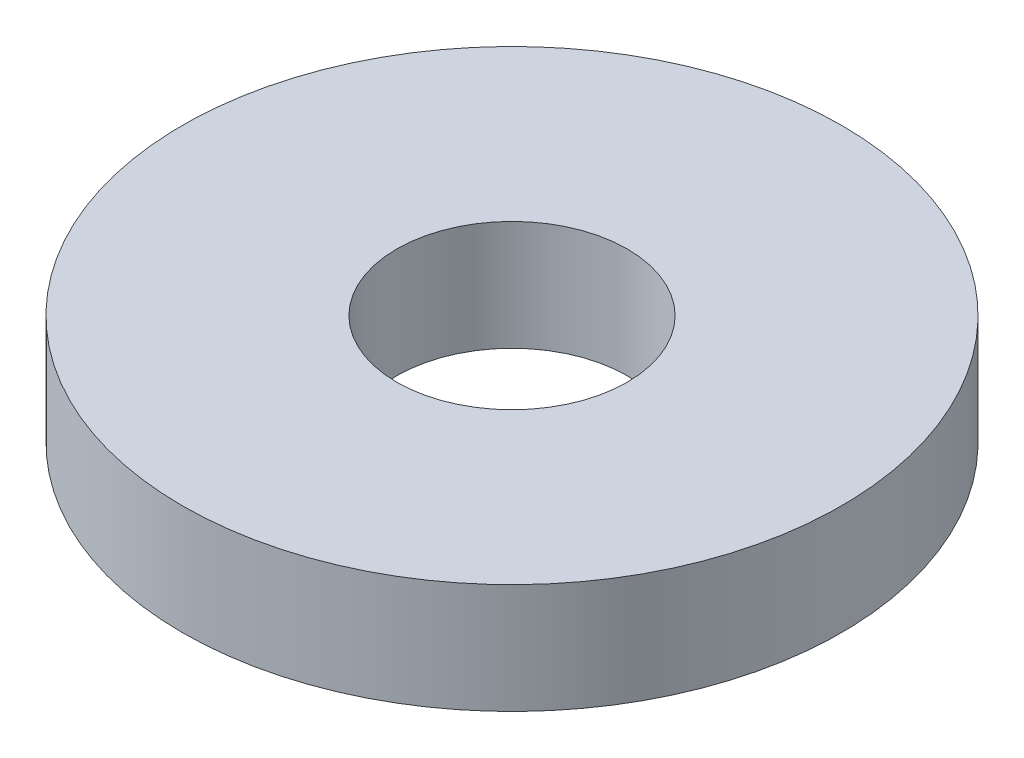
ISO-10303-21;
HEADER;
FILE_DESCRIPTION(('STEP AP214'),'2;1');
FILE_NAME('part.step','',(''),(''),'','','');
FILE_SCHEMA(('AUTOMOTIVE_DESIGN { 1 0 10303 214 1 1 1 1 }'));
ENDSEC;
DATA;
#1=APPLICATION_CONTEXT('core data for automotive mechanical design processes');
#2=APPLICATION_PROTOCOL_DEFINITION('international standard','automotive_design',2000,#1);
#3=PRODUCT_CONTEXT('',#1,'mechanical');
#4=PRODUCT('Part','Part','',(#3));
#5=PRODUCT_RELATED_PRODUCT_CATEGORY('part','',(#4));
#6=PRODUCT_DEFINITION_FORMATION('','',#4);
#7=PRODUCT_DEFINITION_CONTEXT('part definition',#1,'design');
#8=PRODUCT_DEFINITION('design','',#6,#7);
#9=PRODUCT_DEFINITION_SHAPE('','',#8);
#10=(LENGTH_UNIT() NAMED_UNIT(*) SI_UNIT(.MILLI.,.METRE.));
#11=(NAMED_UNIT(*) PLANE_ANGLE_UNIT() SI_UNIT($,.RADIAN.));
#12=(NAMED_UNIT(*) SI_UNIT($,.STERADIAN.) SOLID_ANGLE_UNIT());
#13=UNCERTAINTY_MEASURE_WITH_UNIT(LENGTH_MEASURE(1.E-05),#10,'distance_accuracy_value','');
#14=(GEOMETRIC_REPRESENTATION_CONTEXT(3) GLOBAL_UNCERTAINTY_ASSIGNED_CONTEXT((#13)) GLOBAL_UNIT_ASSIGNED_CONTEXT((#10,
#11,#12)) REPRESENTATION_CONTEXT('',''));
#15=CARTESIAN_POINT('',(0.,0.,0.));
#16=DIRECTION('',(0.,0.,1.));
#17=DIRECTION('',(1.,0.,0.));
#18=AXIS2_PLACEMENT_3D('',#15,#16,#17);
#19=CARTESIAN_POINT('',(0.,2.,0.));
#20=DIRECTION('',(0.,1.,0.));
#21=DIRECTION('',(0.,0.,1.));
#22=AXIS2_PLACEMENT_3D('',#19,#20,#21);
#23=PLANE('',#22);
#24=CARTESIAN_POINT('',(0.,2.,0.));
#25=DIRECTION('',(0.,1.,0.));
#26=DIRECTION('',(0.,0.,1.));
#27=AXIS2_PLACEMENT_3D('',#24,#25,#26);
#28=CIRCLE('',#27,6.);
#29=CARTESIAN_POINT('',(0.,2.,6.));
#30=VERTEX_POINT('',#29);
#31=EDGE_CURVE('E10',#30,#30,#28,.T.);
#32=ORIENTED_EDGE('',*,*,#31,.T.);
#33=EDGE_LOOP('',(#32));
#34=FACE_BOUND('',#33,.T.);
#35=CARTESIAN_POINT('',(0.,2.,0.));
#36=DIRECTION('',(0.,1.,0.));
#37=DIRECTION('',(0.,0.,1.));
#38=AXIS2_PLACEMENT_3D('',#35,#36,#37);
#39=CIRCLE('',#38,2.1);
#40=CARTESIAN_POINT('',(0.,2.,2.1));
#41=VERTEX_POINT('',#40);
#42=EDGE_CURVE('E41',#41,#41,#39,.T.);
#43=ORIENTED_EDGE('',*,*,#42,.F.);
#44=EDGE_LOOP('',(#43));
#45=FACE_BOUND('',#44,.T.);
#46=ADVANCED_FACE('F30',(#34,#45),#23,.T.);
#47=CARTESIAN_POINT('',(0.,0.,0.));
#48=DIRECTION('',(0.,1.,0.));
#49=DIRECTION('',(0.,0.,1.));
#50=AXIS2_PLACEMENT_3D('',#47,#48,#49);
#51=PLANE('',#50);
#52=CARTESIAN_POINT('',(0.,0.,0.));
#53=DIRECTION('',(0.,1.,0.));
#54=DIRECTION('',(0.,0.,1.));
#55=AXIS2_PLACEMENT_3D('',#52,#53,#54);
#56=CIRCLE('',#55,6.);
#57=CARTESIAN_POINT('',(0.,0.,6.));
#58=VERTEX_POINT('',#57);
#59=EDGE_CURVE('E34',#58,#58,#56,.T.);
#60=ORIENTED_EDGE('',*,*,#59,.F.);
#61=EDGE_LOOP('',(#60));
#62=FACE_BOUND('',#61,.T.);
#63=CARTESIAN_POINT('',(0.,0.,0.));
#64=DIRECTION('',(0.,1.,0.));
#65=DIRECTION('',(0.,0.,1.));
#66=AXIS2_PLACEMENT_3D('',#63,#64,#65);
#67=CIRCLE('',#66,2.1);
#68=CARTESIAN_POINT('',(0.,0.,2.1));
#69=VERTEX_POINT('',#68);
#70=EDGE_CURVE('E43',#69,#69,#67,.T.);
#71=ORIENTED_EDGE('',*,*,#70,.T.);
#72=EDGE_LOOP('',(#71));
#73=FACE_BOUND('',#72,.T.);
#74=ADVANCED_FACE('F53',(#62,#73),#51,.F.);
#75=CARTESIAN_POINT('',(0.,2.,0.));
#76=DIRECTION('',(0.,-1.,0.));
#77=DIRECTION('',(0.,0.,-1.));
#78=AXIS2_PLACEMENT_3D('',#75,#76,#77);
#79=CYLINDRICAL_SURFACE('',#78,6.);
#80=ORIENTED_EDGE('',*,*,#31,.F.);
#81=EDGE_LOOP('',(#80));
#82=FACE_BOUND('',#81,.T.);
#83=ORIENTED_EDGE('',*,*,#59,.T.);
#84=EDGE_LOOP('',(#83));
#85=FACE_BOUND('',#84,.T.);
#86=ADVANCED_FACE('F32',(#82,#85),#79,.T.);
#87=CARTESIAN_POINT('',(0.,2.,0.));
#88=DIRECTION('',(0.,-1.,0.));
#89=DIRECTION('',(0.,0.,-1.));
#90=AXIS2_PLACEMENT_3D('',#87,#88,#89);
#91=CYLINDRICAL_SURFACE('',#90,2.1);
#92=ORIENTED_EDGE('',*,*,#42,.T.);
#93=EDGE_LOOP('',(#92));
#94=FACE_BOUND('',#93,.T.);
#95=ORIENTED_EDGE('',*,*,#70,.F.);
#96=EDGE_LOOP('',(#95));
#97=FACE_BOUND('',#96,.T.);
#98=ADVANCED_FACE('F49',(#94,#97),#91,.F.);
#99=CLOSED_SHELL('',(#46,#74,#86,#98));
#100=MANIFOLD_SOLID_BREP('B2',#99);
#101=ADVANCED_BREP_SHAPE_REPRESENTATION('',(#18,#100),#14);
#102=SHAPE_DEFINITION_REPRESENTATION(#9,#101);
ENDSEC;
END-ISO-10303-21;
